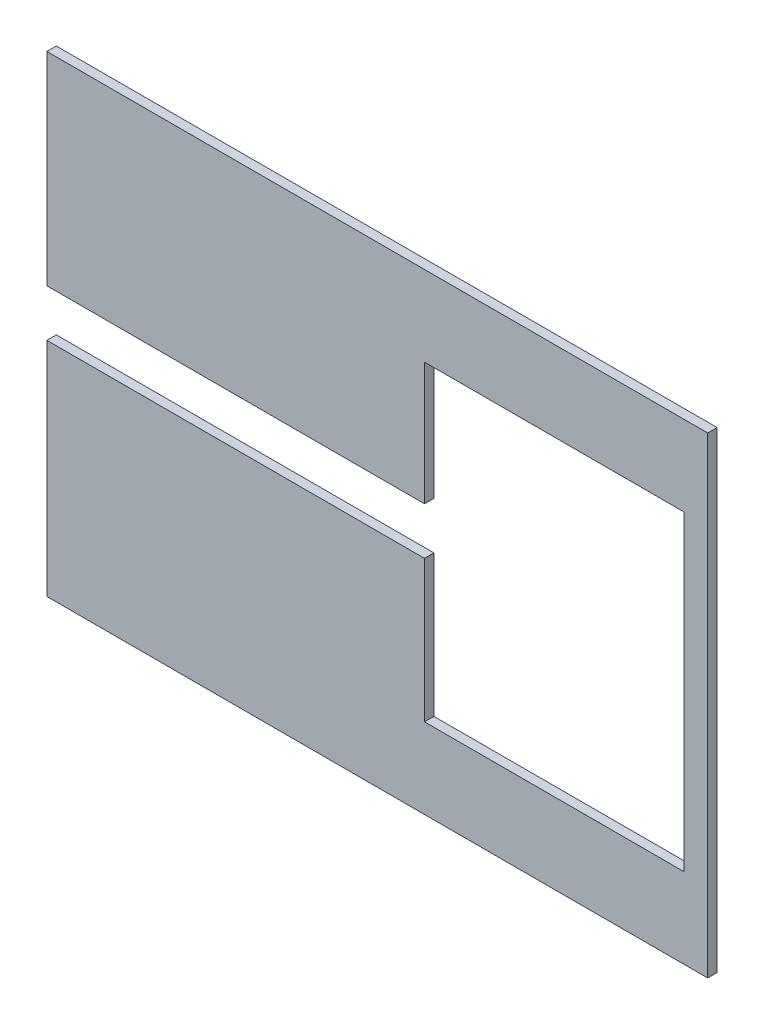
ISO-10303-21;
HEADER;
FILE_DESCRIPTION(('STEP AP214'),'2;1');
FILE_NAME('part.step','',(''),(''),'','','');
FILE_SCHEMA(('AUTOMOTIVE_DESIGN { 1 0 10303 214 1 1 1 1 }'));
ENDSEC;
DATA;
#1=APPLICATION_CONTEXT('core data for automotive mechanical design processes');
#2=APPLICATION_PROTOCOL_DEFINITION('international standard','automotive_design',2000,#1);
#3=PRODUCT_CONTEXT('',#1,'mechanical');
#4=PRODUCT('Part','Part','',(#3));
#5=PRODUCT_RELATED_PRODUCT_CATEGORY('part','',(#4));
#6=PRODUCT_DEFINITION_FORMATION('','',#4);
#7=PRODUCT_DEFINITION_CONTEXT('part definition',#1,'design');
#8=PRODUCT_DEFINITION('design','',#6,#7);
#9=PRODUCT_DEFINITION_SHAPE('','',#8);
#10=(LENGTH_UNIT() NAMED_UNIT(*) SI_UNIT(.MILLI.,.METRE.));
#11=(NAMED_UNIT(*) PLANE_ANGLE_UNIT() SI_UNIT($,.RADIAN.));
#12=(NAMED_UNIT(*) SI_UNIT($,.STERADIAN.) SOLID_ANGLE_UNIT());
#13=UNCERTAINTY_MEASURE_WITH_UNIT(LENGTH_MEASURE(1.E-05),#10,'distance_accuracy_value','');
#14=(GEOMETRIC_REPRESENTATION_CONTEXT(3) GLOBAL_UNCERTAINTY_ASSIGNED_CONTEXT((#13)) GLOBAL_UNIT_ASSIGNED_CONTEXT((#10,
#11,#12)) REPRESENTATION_CONTEXT('',''));
#15=CARTESIAN_POINT('',(0.,0.,0.));
#16=DIRECTION('',(0.,0.,1.));
#17=DIRECTION('',(1.,0.,0.));
#18=AXIS2_PLACEMENT_3D('',#15,#16,#17);
#19=CARTESIAN_POINT('',(0.,0.,2.));
#20=DIRECTION('',(1.,0.,0.));
#21=DIRECTION('',(0.,1.,0.));
#22=AXIS2_PLACEMENT_3D('',#19,#20,#21);
#23=PLANE('',#22);
#24=DIRECTION('',(0.,0.,1.));
#25=VECTOR('',#24,1.);
#26=CARTESIAN_POINT('',(0.,47.,-1.));
#27=LINE('',#26,#25);
#28=CARTESIAN_POINT('',(0.,47.,0.));
#29=VERTEX_POINT('',#28);
#30=CARTESIAN_POINT('',(0.,47.,2.));
#31=VERTEX_POINT('',#30);
#32=EDGE_CURVE('E226',#29,#31,#27,.T.);
#33=ORIENTED_EDGE('',*,*,#32,.F.);
#34=DIRECTION('',(0.,-1.,0.));
#35=VECTOR('',#34,1.);
#36=CARTESIAN_POINT('',(0.,0.,0.));
#37=LINE('',#36,#35);
#38=CARTESIAN_POINT('',(0.,0.,0.));
#39=VERTEX_POINT('',#38);
#40=EDGE_CURVE('E165',#29,#39,#37,.T.);
#41=ORIENTED_EDGE('',*,*,#40,.T.);
#42=DIRECTION('',(0.,0.,-1.));
#43=VECTOR('',#42,1.);
#44=CARTESIAN_POINT('',(0.,0.,2.));
#45=LINE('',#44,#43);
#46=CARTESIAN_POINT('',(0.,0.,2.));
#47=VERTEX_POINT('',#46);
#48=EDGE_CURVE('E133',#47,#39,#45,.T.);
#49=ORIENTED_EDGE('',*,*,#48,.F.);
#50=DIRECTION('',(0.,-1.,0.));
#51=VECTOR('',#50,1.);
#52=CARTESIAN_POINT('',(0.,0.,2.));
#53=LINE('',#52,#51);
#54=EDGE_CURVE('E180',#31,#47,#53,.T.);
#55=ORIENTED_EDGE('',*,*,#54,.F.);
#56=EDGE_LOOP('',(#33,#41,#49,#55));
#57=FACE_BOUND('',#56,.T.);
#58=ADVANCED_FACE('F39',(#57),#23,.F.);
#59=CARTESIAN_POINT('',(0.,0.,2.));
#60=DIRECTION('',(0.,0.,-1.));
#61=DIRECTION('',(-1.,0.,0.));
#62=AXIS2_PLACEMENT_3D('',#59,#60,#61);
#63=PLANE('',#62);
#64=DIRECTION('',(-1.,0.,0.));
#65=VECTOR('',#64,1.);
#66=CARTESIAN_POINT('',(0.,47.,2.));
#67=LINE('',#66,#65);
#68=CARTESIAN_POINT('',(80.,47.,2.));
#69=VERTEX_POINT('',#68);
#70=EDGE_CURVE('E62',#69,#31,#67,.T.);
#71=ORIENTED_EDGE('',*,*,#70,.T.);
#72=ORIENTED_EDGE('',*,*,#54,.T.);
#73=DIRECTION('',(1.,0.,0.));
#74=VECTOR('',#73,1.);
#75=CARTESIAN_POINT('',(0.,0.,2.));
#76=LINE('',#75,#74);
#77=CARTESIAN_POINT('',(140.,0.,2.));
#78=VERTEX_POINT('',#77);
#79=EDGE_CURVE('E179',#47,#78,#76,.T.);
#80=ORIENTED_EDGE('',*,*,#79,.T.);
#81=DIRECTION('',(0.,1.,0.));
#82=VECTOR('',#81,1.);
#83=CARTESIAN_POINT('',(140.,0.,2.));
#84=LINE('',#83,#82);
#85=CARTESIAN_POINT('',(140.,100.,2.));
#86=VERTEX_POINT('',#85);
#87=EDGE_CURVE('E183',#78,#86,#84,.T.);
#88=ORIENTED_EDGE('',*,*,#87,.T.);
#89=DIRECTION('',(-1.,0.,0.));
#90=VECTOR('',#89,1.);
#91=CARTESIAN_POINT('',(0.,100.,2.));
#92=LINE('',#91,#90);
#93=CARTESIAN_POINT('',(0.,100.,2.));
#94=VERTEX_POINT('',#93);
#95=EDGE_CURVE('E186',#86,#94,#92,.T.);
#96=ORIENTED_EDGE('',*,*,#95,.T.);
#97=CARTESIAN_POINT('',(0.,57.,2.));
#98=VERTEX_POINT('',#97);
#99=EDGE_CURVE('E141',#94,#98,#53,.T.);
#100=ORIENTED_EDGE('',*,*,#99,.T.);
#101=DIRECTION('',(-1.,0.,0.));
#102=VECTOR('',#101,1.);
#103=CARTESIAN_POINT('',(0.,57.,2.));
#104=LINE('',#103,#102);
#105=CARTESIAN_POINT('',(80.,57.,2.));
#106=VERTEX_POINT('',#105);
#107=EDGE_CURVE('E127',#106,#98,#104,.T.);
#108=ORIENTED_EDGE('',*,*,#107,.F.);
#109=DIRECTION('',(0.,-1.,0.));
#110=VECTOR('',#109,1.);
#111=CARTESIAN_POINT('',(80.,83.,2.));
#112=LINE('',#111,#110);
#113=CARTESIAN_POINT('',(80.,83.,2.));
#114=VERTEX_POINT('',#113);
#115=EDGE_CURVE('E139',#114,#106,#112,.T.);
#116=ORIENTED_EDGE('',*,*,#115,.F.);
#117=DIRECTION('',(-1.,0.,0.));
#118=VECTOR('',#117,1.);
#119=CARTESIAN_POINT('',(135.,83.,2.));
#120=LINE('',#119,#118);
#121=CARTESIAN_POINT('',(135.,83.,2.));
#122=VERTEX_POINT('',#121);
#123=EDGE_CURVE('E158',#122,#114,#120,.T.);
#124=ORIENTED_EDGE('',*,*,#123,.F.);
#125=DIRECTION('',(0.,1.,0.));
#126=VECTOR('',#125,1.);
#127=CARTESIAN_POINT('',(135.,83.,2.));
#128=LINE('',#127,#126);
#129=CARTESIAN_POINT('',(135.,17.,2.));
#130=VERTEX_POINT('',#129);
#131=EDGE_CURVE('E263',#130,#122,#128,.T.);
#132=ORIENTED_EDGE('',*,*,#131,.F.);
#133=DIRECTION('',(1.,0.,0.));
#134=VECTOR('',#133,1.);
#135=CARTESIAN_POINT('',(135.,17.,2.));
#136=LINE('',#135,#134);
#137=CARTESIAN_POINT('',(80.,17.,2.));
#138=VERTEX_POINT('',#137);
#139=EDGE_CURVE('E150',#138,#130,#136,.T.);
#140=ORIENTED_EDGE('',*,*,#139,.F.);
#141=EDGE_CURVE('E151',#69,#138,#112,.T.);
#142=ORIENTED_EDGE('',*,*,#141,.F.);
#143=EDGE_LOOP('',(#71,#72,#80,#88,#96,#100,#108,#116,#124,#132,#140,#142));
#144=FACE_BOUND('',#143,.T.);
#145=ADVANCED_FACE('F137',(#144),#63,.F.);
#146=CARTESIAN_POINT('',(0.,0.,0.));
#147=DIRECTION('',(0.,0.,-1.));
#148=DIRECTION('',(-1.,0.,0.));
#149=AXIS2_PLACEMENT_3D('',#146,#147,#148);
#150=PLANE('',#149);
#151=ORIENTED_EDGE('',*,*,#40,.F.);
#152=DIRECTION('',(1.,0.,0.));
#153=VECTOR('',#152,1.);
#154=CARTESIAN_POINT('',(0.,47.,0.));
#155=LINE('',#154,#153);
#156=CARTESIAN_POINT('',(80.,47.,0.));
#157=VERTEX_POINT('',#156);
#158=EDGE_CURVE('E261',#29,#157,#155,.T.);
#159=ORIENTED_EDGE('',*,*,#158,.T.);
#160=DIRECTION('',(0.,-1.,0.));
#161=VECTOR('',#160,1.);
#162=CARTESIAN_POINT('',(80.,83.,0.));
#163=LINE('',#162,#161);
#164=CARTESIAN_POINT('',(80.,17.,0.));
#165=VERTEX_POINT('',#164);
#166=EDGE_CURVE('E250',#157,#165,#163,.T.);
#167=ORIENTED_EDGE('',*,*,#166,.T.);
#168=DIRECTION('',(1.,0.,0.));
#169=VECTOR('',#168,1.);
#170=CARTESIAN_POINT('',(135.,17.,0.));
#171=LINE('',#170,#169);
#172=CARTESIAN_POINT('',(135.,17.,0.));
#173=VERTEX_POINT('',#172);
#174=EDGE_CURVE('E176',#165,#173,#171,.T.);
#175=ORIENTED_EDGE('',*,*,#174,.T.);
#176=DIRECTION('',(0.,1.,0.));
#177=VECTOR('',#176,1.);
#178=CARTESIAN_POINT('',(135.,83.,0.));
#179=LINE('',#178,#177);
#180=CARTESIAN_POINT('',(135.,83.,0.));
#181=VERTEX_POINT('',#180);
#182=EDGE_CURVE('E156',#173,#181,#179,.T.);
#183=ORIENTED_EDGE('',*,*,#182,.T.);
#184=DIRECTION('',(-1.,0.,0.));
#185=VECTOR('',#184,1.);
#186=CARTESIAN_POINT('',(135.,83.,0.));
#187=LINE('',#186,#185);
#188=CARTESIAN_POINT('',(80.,83.,0.));
#189=VERTEX_POINT('',#188);
#190=EDGE_CURVE('E253',#181,#189,#187,.T.);
#191=ORIENTED_EDGE('',*,*,#190,.T.);
#192=CARTESIAN_POINT('',(80.,57.,0.));
#193=VERTEX_POINT('',#192);
#194=EDGE_CURVE('E247',#189,#193,#163,.T.);
#195=ORIENTED_EDGE('',*,*,#194,.T.);
#196=DIRECTION('',(1.,0.,0.));
#197=VECTOR('',#196,1.);
#198=CARTESIAN_POINT('',(0.,57.,0.));
#199=LINE('',#198,#197);
#200=CARTESIAN_POINT('',(0.,57.,0.));
#201=VERTEX_POINT('',#200);
#202=EDGE_CURVE('E55',#201,#193,#199,.T.);
#203=ORIENTED_EDGE('',*,*,#202,.F.);
#204=CARTESIAN_POINT('',(0.,100.,0.));
#205=VERTEX_POINT('',#204);
#206=EDGE_CURVE('E190',#205,#201,#37,.T.);
#207=ORIENTED_EDGE('',*,*,#206,.F.);
#208=DIRECTION('',(-1.,0.,0.));
#209=VECTOR('',#208,1.);
#210=CARTESIAN_POINT('',(0.,100.,0.));
#211=LINE('',#210,#209);
#212=CARTESIAN_POINT('',(140.,100.,0.));
#213=VERTEX_POINT('',#212);
#214=EDGE_CURVE('E200',#213,#205,#211,.T.);
#215=ORIENTED_EDGE('',*,*,#214,.F.);
#216=DIRECTION('',(0.,1.,0.));
#217=VECTOR('',#216,1.);
#218=CARTESIAN_POINT('',(140.,0.,0.));
#219=LINE('',#218,#217);
#220=CARTESIAN_POINT('',(140.,0.,0.));
#221=VERTEX_POINT('',#220);
#222=EDGE_CURVE('E197',#221,#213,#219,.T.);
#223=ORIENTED_EDGE('',*,*,#222,.F.);
#224=DIRECTION('',(1.,0.,0.));
#225=VECTOR('',#224,1.);
#226=CARTESIAN_POINT('',(0.,0.,0.));
#227=LINE('',#226,#225);
#228=EDGE_CURVE('E194',#39,#221,#227,.T.);
#229=ORIENTED_EDGE('',*,*,#228,.F.);
#230=EDGE_LOOP('',(#151,#159,#167,#175,#183,#191,#195,#203,#207,#215,#223,#229));
#231=FACE_BOUND('',#230,.T.);
#232=ADVANCED_FACE('F231',(#231),#150,.T.);
#233=CARTESIAN_POINT('',(80.,83.,0.));
#234=DIRECTION('',(-1.,0.,0.));
#235=DIRECTION('',(0.,-1.,0.));
#236=AXIS2_PLACEMENT_3D('',#233,#234,#235);
#237=PLANE('',#236);
#238=DIRECTION('',(0.,0.,-1.));
#239=VECTOR('',#238,1.);
#240=CARTESIAN_POINT('',(80.,47.,0.));
#241=LINE('',#240,#239);
#242=EDGE_CURVE('E11',#69,#157,#241,.T.);
#243=ORIENTED_EDGE('',*,*,#242,.F.);
#244=ORIENTED_EDGE('',*,*,#141,.T.);
#245=DIRECTION('',(0.,0.,1.));
#246=VECTOR('',#245,1.);
#247=CARTESIAN_POINT('',(80.,17.,0.));
#248=LINE('',#247,#246);
#249=EDGE_CURVE('E166',#165,#138,#248,.T.);
#250=ORIENTED_EDGE('',*,*,#249,.F.);
#251=ORIENTED_EDGE('',*,*,#166,.F.);
#252=EDGE_LOOP('',(#243,#244,#250,#251));
#253=FACE_BOUND('',#252,.T.);
#254=ADVANCED_FACE('F287',(#253),#237,.F.);
#255=ORIENTED_EDGE('',*,*,#206,.T.);
#256=DIRECTION('',(0.,0.,1.));
#257=VECTOR('',#256,1.);
#258=CARTESIAN_POINT('',(0.,57.,-1.));
#259=LINE('',#258,#257);
#260=EDGE_CURVE('E143',#201,#98,#259,.T.);
#261=ORIENTED_EDGE('',*,*,#260,.T.);
#262=ORIENTED_EDGE('',*,*,#99,.F.);
#263=DIRECTION('',(0.,0.,-1.));
#264=VECTOR('',#263,1.);
#265=CARTESIAN_POINT('',(0.,100.,2.));
#266=LINE('',#265,#264);
#267=EDGE_CURVE('E189',#94,#205,#266,.T.);
#268=ORIENTED_EDGE('',*,*,#267,.T.);
#269=EDGE_LOOP('',(#255,#261,#262,#268));
#270=FACE_BOUND('',#269,.T.);
#271=ADVANCED_FACE('F41',(#270),#23,.F.);
#272=CARTESIAN_POINT('',(0.,0.,2.));
#273=DIRECTION('',(0.,1.,0.));
#274=DIRECTION('',(0.,0.,1.));
#275=AXIS2_PLACEMENT_3D('',#272,#273,#274);
#276=PLANE('',#275);
#277=ORIENTED_EDGE('',*,*,#228,.T.);
#278=DIRECTION('',(0.,0.,-1.));
#279=VECTOR('',#278,1.);
#280=CARTESIAN_POINT('',(140.,0.,2.));
#281=LINE('',#280,#279);
#282=EDGE_CURVE('E210',#78,#221,#281,.T.);
#283=ORIENTED_EDGE('',*,*,#282,.F.);
#284=ORIENTED_EDGE('',*,*,#79,.F.);
#285=ORIENTED_EDGE('',*,*,#48,.T.);
#286=EDGE_LOOP('',(#277,#283,#284,#285));
#287=FACE_BOUND('',#286,.T.);
#288=ADVANCED_FACE('F219',(#287),#276,.F.);
#289=CARTESIAN_POINT('',(140.,0.,2.));
#290=DIRECTION('',(-1.,0.,0.));
#291=DIRECTION('',(0.,-1.,0.));
#292=AXIS2_PLACEMENT_3D('',#289,#290,#291);
#293=PLANE('',#292);
#294=ORIENTED_EDGE('',*,*,#222,.T.);
#295=DIRECTION('',(0.,0.,-1.));
#296=VECTOR('',#295,1.);
#297=CARTESIAN_POINT('',(140.,100.,2.));
#298=LINE('',#297,#296);
#299=EDGE_CURVE('E206',#86,#213,#298,.T.);
#300=ORIENTED_EDGE('',*,*,#299,.F.);
#301=ORIENTED_EDGE('',*,*,#87,.F.);
#302=ORIENTED_EDGE('',*,*,#282,.T.);
#303=EDGE_LOOP('',(#294,#300,#301,#302));
#304=FACE_BOUND('',#303,.T.);
#305=ADVANCED_FACE('F236',(#304),#293,.F.);
#306=CARTESIAN_POINT('',(0.,100.,2.));
#307=DIRECTION('',(0.,-1.,0.));
#308=DIRECTION('',(0.,0.,-1.));
#309=AXIS2_PLACEMENT_3D('',#306,#307,#308);
#310=PLANE('',#309);
#311=ORIENTED_EDGE('',*,*,#214,.T.);
#312=ORIENTED_EDGE('',*,*,#267,.F.);
#313=ORIENTED_EDGE('',*,*,#95,.F.);
#314=ORIENTED_EDGE('',*,*,#299,.T.);
#315=EDGE_LOOP('',(#311,#312,#313,#314));
#316=FACE_BOUND('',#315,.T.);
#317=ADVANCED_FACE('F240',(#316),#310,.F.);
#318=CARTESIAN_POINT('',(135.,83.,0.));
#319=DIRECTION('',(1.,0.,0.));
#320=DIRECTION('',(0.,0.,-1.));
#321=AXIS2_PLACEMENT_3D('',#318,#319,#320);
#322=PLANE('',#321);
#323=ORIENTED_EDGE('',*,*,#131,.T.);
#324=DIRECTION('',(0.,0.,1.));
#325=VECTOR('',#324,1.);
#326=CARTESIAN_POINT('',(135.,83.,0.));
#327=LINE('',#326,#325);
#328=EDGE_CURVE('E172',#181,#122,#327,.T.);
#329=ORIENTED_EDGE('',*,*,#328,.F.);
#330=ORIENTED_EDGE('',*,*,#182,.F.);
#331=DIRECTION('',(0.,0.,1.));
#332=VECTOR('',#331,1.);
#333=CARTESIAN_POINT('',(135.,17.,0.));
#334=LINE('',#333,#332);
#335=EDGE_CURVE('E162',#173,#130,#334,.T.);
#336=ORIENTED_EDGE('',*,*,#335,.T.);
#337=EDGE_LOOP('',(#323,#329,#330,#336));
#338=FACE_BOUND('',#337,.T.);
#339=ADVANCED_FACE('F317',(#338),#322,.F.);
#340=CARTESIAN_POINT('',(135.,17.,0.));
#341=DIRECTION('',(0.,-1.,0.));
#342=DIRECTION('',(1.,0.,0.));
#343=AXIS2_PLACEMENT_3D('',#340,#341,#342);
#344=PLANE('',#343);
#345=ORIENTED_EDGE('',*,*,#139,.T.);
#346=ORIENTED_EDGE('',*,*,#335,.F.);
#347=ORIENTED_EDGE('',*,*,#174,.F.);
#348=ORIENTED_EDGE('',*,*,#249,.T.);
#349=EDGE_LOOP('',(#345,#346,#347,#348));
#350=FACE_BOUND('',#349,.T.);
#351=ADVANCED_FACE('F283',(#350),#344,.F.);
#352=ORIENTED_EDGE('',*,*,#115,.T.);
#353=DIRECTION('',(0.,0.,-1.));
#354=VECTOR('',#353,1.);
#355=CARTESIAN_POINT('',(80.,57.,0.));
#356=LINE('',#355,#354);
#357=EDGE_CURVE('E48',#106,#193,#356,.T.);
#358=ORIENTED_EDGE('',*,*,#357,.T.);
#359=ORIENTED_EDGE('',*,*,#194,.F.);
#360=DIRECTION('',(0.,0.,1.));
#361=VECTOR('',#360,1.);
#362=CARTESIAN_POINT('',(80.,83.,0.));
#363=LINE('',#362,#361);
#364=EDGE_CURVE('E147',#189,#114,#363,.T.);
#365=ORIENTED_EDGE('',*,*,#364,.T.);
#366=EDGE_LOOP('',(#352,#358,#359,#365));
#367=FACE_BOUND('',#366,.T.);
#368=ADVANCED_FACE('F145',(#367),#237,.F.);
#369=CARTESIAN_POINT('',(135.,83.,0.));
#370=DIRECTION('',(0.,1.,0.));
#371=DIRECTION('',(-1.,0.,0.));
#372=AXIS2_PLACEMENT_3D('',#369,#370,#371);
#373=PLANE('',#372);
#374=ORIENTED_EDGE('',*,*,#123,.T.);
#375=ORIENTED_EDGE('',*,*,#364,.F.);
#376=ORIENTED_EDGE('',*,*,#190,.F.);
#377=ORIENTED_EDGE('',*,*,#328,.T.);
#378=EDGE_LOOP('',(#374,#375,#376,#377));
#379=FACE_BOUND('',#378,.T.);
#380=ADVANCED_FACE('F280',(#379),#373,.F.);
#381=CARTESIAN_POINT('',(0.,57.,-1.));
#382=DIRECTION('',(0.,1.,0.));
#383=DIRECTION('',(0.,0.,1.));
#384=AXIS2_PLACEMENT_3D('',#381,#382,#383);
#385=PLANE('',#384);
#386=ORIENTED_EDGE('',*,*,#202,.T.);
#387=ORIENTED_EDGE('',*,*,#357,.F.);
#388=ORIENTED_EDGE('',*,*,#107,.T.);
#389=ORIENTED_EDGE('',*,*,#260,.F.);
#390=EDGE_LOOP('',(#386,#387,#388,#389));
#391=FACE_BOUND('',#390,.T.);
#392=ADVANCED_FACE('F126',(#391),#385,.F.);
#393=CARTESIAN_POINT('',(0.,47.,-1.));
#394=DIRECTION('',(0.,1.,0.));
#395=DIRECTION('',(-1.,0.,0.));
#396=AXIS2_PLACEMENT_3D('',#393,#394,#395);
#397=PLANE('',#396);
#398=ORIENTED_EDGE('',*,*,#32,.T.);
#399=ORIENTED_EDGE('',*,*,#70,.F.);
#400=ORIENTED_EDGE('',*,*,#242,.T.);
#401=ORIENTED_EDGE('',*,*,#158,.F.);
#402=EDGE_LOOP('',(#398,#399,#400,#401));
#403=FACE_BOUND('',#402,.T.);
#404=ADVANCED_FACE('F288',(#403),#397,.T.);
#405=CLOSED_SHELL('',(#58,#145,#232,#254,#271,#288,#305,#317,#339,#351,#368,#380,#392,#404));
#406=MANIFOLD_SOLID_BREP('B2',#405);
#407=ADVANCED_BREP_SHAPE_REPRESENTATION('',(#18,#406),#14);
#408=SHAPE_DEFINITION_REPRESENTATION(#9,#407);
ENDSEC;
END-ISO-10303-21;
